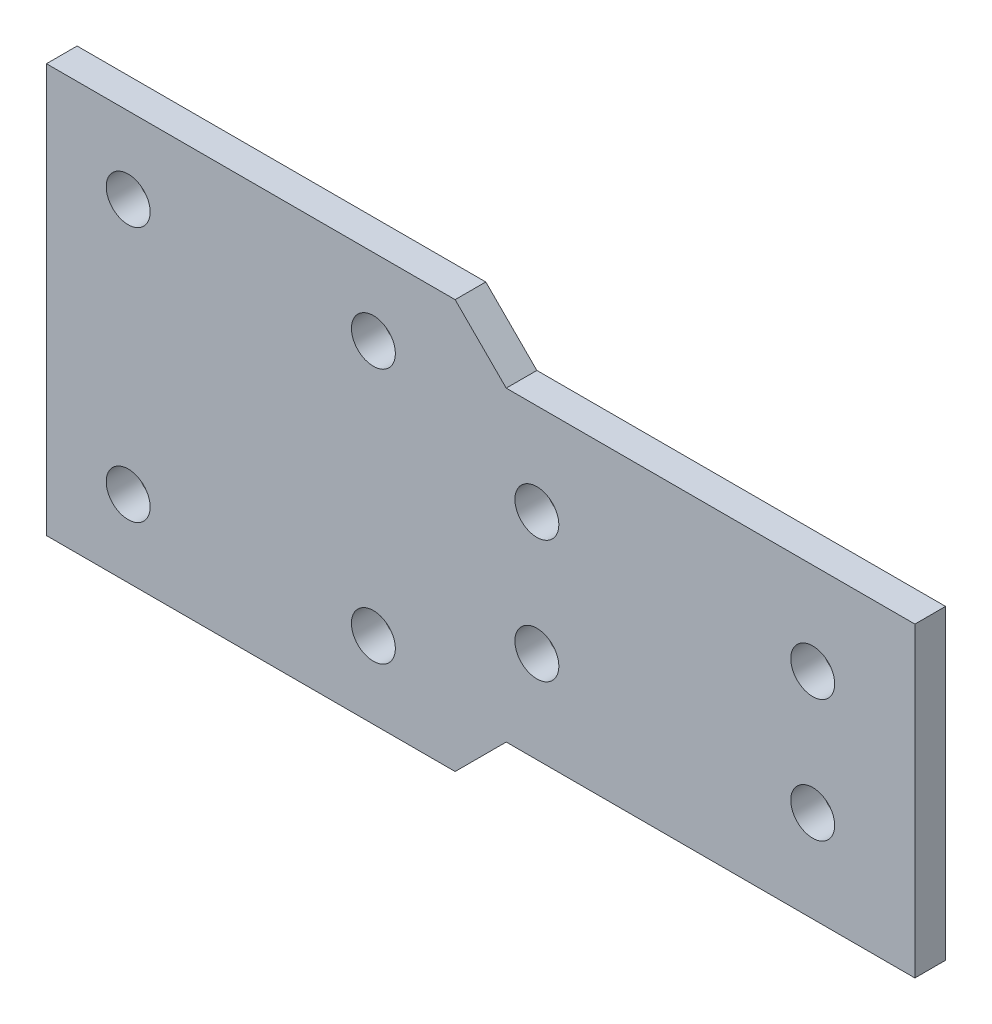
ISO-10303-21;
HEADER;
FILE_DESCRIPTION(('STEP AP214'),'2;1');
FILE_NAME('part.step','',(''),(''),'','','');
FILE_SCHEMA(('AUTOMOTIVE_DESIGN { 1 0 10303 214 1 1 1 1 }'));
ENDSEC;
DATA;
#1=APPLICATION_CONTEXT('core data for automotive mechanical design processes');
#2=APPLICATION_PROTOCOL_DEFINITION('international standard','automotive_design',2000,#1);
#3=PRODUCT_CONTEXT('',#1,'mechanical');
#4=PRODUCT('Part','Part','',(#3));
#5=PRODUCT_RELATED_PRODUCT_CATEGORY('part','',(#4));
#6=PRODUCT_DEFINITION_FORMATION('','',#4);
#7=PRODUCT_DEFINITION_CONTEXT('part definition',#1,'design');
#8=PRODUCT_DEFINITION('design','',#6,#7);
#9=PRODUCT_DEFINITION_SHAPE('','',#8);
#10=(LENGTH_UNIT() NAMED_UNIT(*) SI_UNIT(.MILLI.,.METRE.));
#11=(NAMED_UNIT(*) PLANE_ANGLE_UNIT() SI_UNIT($,.RADIAN.));
#12=(NAMED_UNIT(*) SI_UNIT($,.STERADIAN.) SOLID_ANGLE_UNIT());
#13=UNCERTAINTY_MEASURE_WITH_UNIT(LENGTH_MEASURE(1.E-05),#10,'distance_accuracy_value','');
#14=(GEOMETRIC_REPRESENTATION_CONTEXT(3) GLOBAL_UNCERTAINTY_ASSIGNED_CONTEXT((#13)) GLOBAL_UNIT_ASSIGNED_CONTEXT((#10,
#11,#12)) REPRESENTATION_CONTEXT('',''));
#15=CARTESIAN_POINT('',(0.,0.,0.));
#16=DIRECTION('',(0.,0.,1.));
#17=DIRECTION('',(1.,0.,0.));
#18=AXIS2_PLACEMENT_3D('',#15,#16,#17);
#19=CARTESIAN_POINT('',(0.,0.,3.));
#20=DIRECTION('',(0.,0.,1.));
#21=DIRECTION('',(1.,0.,0.));
#22=AXIS2_PLACEMENT_3D('',#19,#20,#21);
#23=PLANE('',#22);
#24=CARTESIAN_POINT('',(35.,5.99999999999999,3.));
#25=DIRECTION('',(0.,0.,1.));
#26=DIRECTION('',(1.,0.,0.));
#27=AXIS2_PLACEMENT_3D('',#24,#25,#26);
#28=CIRCLE('',#27,2.15);
#29=CARTESIAN_POINT('',(37.15,5.99999999999999,3.));
#30=VERTEX_POINT('',#29);
#31=EDGE_CURVE('E213',#30,#30,#28,.T.);
#32=ORIENTED_EDGE('',*,*,#31,.F.);
#33=EDGE_LOOP('',(#32));
#34=FACE_BOUND('',#33,.T.);
#35=CARTESIAN_POINT('',(8.,-6.00000000000001,3.));
#36=DIRECTION('',(0.,0.,1.));
#37=DIRECTION('',(1.,0.,0.));
#38=AXIS2_PLACEMENT_3D('',#35,#36,#37);
#39=CIRCLE('',#38,2.15);
#40=CARTESIAN_POINT('',(10.15,-6.00000000000001,3.));
#41=VERTEX_POINT('',#40);
#42=EDGE_CURVE('E201',#41,#41,#39,.T.);
#43=ORIENTED_EDGE('',*,*,#42,.F.);
#44=EDGE_LOOP('',(#43));
#45=FACE_BOUND('',#44,.T.);
#46=CARTESIAN_POINT('',(-32.,-12.5,3.));
#47=DIRECTION('',(0.,0.,1.));
#48=DIRECTION('',(1.,0.,0.));
#49=AXIS2_PLACEMENT_3D('',#46,#47,#48);
#50=CIRCLE('',#49,2.15);
#51=CARTESIAN_POINT('',(-29.85,-12.5,3.));
#52=VERTEX_POINT('',#51);
#53=EDGE_CURVE('E189',#52,#52,#50,.T.);
#54=ORIENTED_EDGE('',*,*,#53,.F.);
#55=EDGE_LOOP('',(#54));
#56=FACE_BOUND('',#55,.T.);
#57=CARTESIAN_POINT('',(-32.,12.5,3.));
#58=DIRECTION('',(0.,0.,1.));
#59=DIRECTION('',(1.,0.,0.));
#60=AXIS2_PLACEMENT_3D('',#57,#58,#59);
#61=CIRCLE('',#60,2.15);
#62=CARTESIAN_POINT('',(-29.85,12.5,3.));
#63=VERTEX_POINT('',#62);
#64=EDGE_CURVE('E135',#63,#63,#61,.T.);
#65=ORIENTED_EDGE('',*,*,#64,.F.);
#66=EDGE_LOOP('',(#65));
#67=FACE_BOUND('',#66,.T.);
#68=DIRECTION('',(0.,-1.,0.));
#69=VECTOR('',#68,1.);
#70=CARTESIAN_POINT('',(-40.,20.,3.));
#71=LINE('',#70,#69);
#72=CARTESIAN_POINT('',(-40.,20.,3.));
#73=VERTEX_POINT('',#72);
#74=CARTESIAN_POINT('',(-40.,-20.,3.));
#75=VERTEX_POINT('',#74);
#76=EDGE_CURVE('E146',#73,#75,#71,.T.);
#77=ORIENTED_EDGE('',*,*,#76,.T.);
#78=DIRECTION('',(1.,0.,0.));
#79=VECTOR('',#78,1.);
#80=CARTESIAN_POINT('',(-40.,-20.,3.));
#81=LINE('',#80,#79);
#82=CARTESIAN_POINT('',(0.,-20.,3.));
#83=VERTEX_POINT('',#82);
#84=EDGE_CURVE('E94',#75,#83,#81,.T.);
#85=ORIENTED_EDGE('',*,*,#84,.T.);
#86=DIRECTION('',(0.707106781186551,0.707106781186544,0.));
#87=VECTOR('',#86,1.);
#88=CARTESIAN_POINT('',(5.00000000000006,-15.,3.));
#89=LINE('',#88,#87);
#90=CARTESIAN_POINT('',(5.00000000000006,-15.,3.));
#91=VERTEX_POINT('',#90);
#92=EDGE_CURVE('E161',#83,#91,#89,.T.);
#93=ORIENTED_EDGE('',*,*,#92,.T.);
#94=DIRECTION('',(1.,0.,0.));
#95=VECTOR('',#94,1.);
#96=CARTESIAN_POINT('',(5.00000000000006,-15.,3.));
#97=LINE('',#96,#95);
#98=CARTESIAN_POINT('',(45.,-15.,3.));
#99=VERTEX_POINT('',#98);
#100=EDGE_CURVE('E174',#91,#99,#97,.T.);
#101=ORIENTED_EDGE('',*,*,#100,.T.);
#102=DIRECTION('',(0.,1.,0.));
#103=VECTOR('',#102,1.);
#104=CARTESIAN_POINT('',(45.,15.,3.));
#105=LINE('',#104,#103);
#106=CARTESIAN_POINT('',(45.,15.,3.));
#107=VERTEX_POINT('',#106);
#108=EDGE_CURVE('E113',#99,#107,#105,.T.);
#109=ORIENTED_EDGE('',*,*,#108,.T.);
#110=DIRECTION('',(-1.,0.,0.));
#111=VECTOR('',#110,1.);
#112=CARTESIAN_POINT('',(4.99999999999999,15.,3.));
#113=LINE('',#112,#111);
#114=CARTESIAN_POINT('',(4.99999999999999,15.,3.));
#115=VERTEX_POINT('',#114);
#116=EDGE_CURVE('E107',#107,#115,#113,.T.);
#117=ORIENTED_EDGE('',*,*,#116,.T.);
#118=DIRECTION('',(-0.707106781186546,0.707106781186549,0.));
#119=VECTOR('',#118,1.);
#120=CARTESIAN_POINT('',(0.,20.,3.));
#121=LINE('',#120,#119);
#122=CARTESIAN_POINT('',(0.,20.,3.));
#123=VERTEX_POINT('',#122);
#124=EDGE_CURVE('E111',#115,#123,#121,.T.);
#125=ORIENTED_EDGE('',*,*,#124,.T.);
#126=DIRECTION('',(-1.,0.,0.));
#127=VECTOR('',#126,1.);
#128=CARTESIAN_POINT('',(-40.,20.,3.));
#129=LINE('',#128,#127);
#130=EDGE_CURVE('E51',#123,#73,#129,.T.);
#131=ORIENTED_EDGE('',*,*,#130,.T.);
#132=EDGE_LOOP('',(#77,#85,#93,#101,#109,#117,#125,#131));
#133=FACE_BOUND('',#132,.T.);
#134=CARTESIAN_POINT('',(-8.,12.5,3.));
#135=DIRECTION('',(0.,0.,1.));
#136=DIRECTION('',(1.,0.,0.));
#137=AXIS2_PLACEMENT_3D('',#134,#135,#136);
#138=CIRCLE('',#137,2.15);
#139=CARTESIAN_POINT('',(-5.85,12.5,3.));
#140=VERTEX_POINT('',#139);
#141=EDGE_CURVE('E183',#140,#140,#138,.T.);
#142=ORIENTED_EDGE('',*,*,#141,.F.);
#143=EDGE_LOOP('',(#142));
#144=FACE_BOUND('',#143,.T.);
#145=CARTESIAN_POINT('',(-8.00000000000001,-12.5,3.));
#146=DIRECTION('',(0.,0.,1.));
#147=DIRECTION('',(1.,0.,0.));
#148=AXIS2_PLACEMENT_3D('',#145,#146,#147);
#149=CIRCLE('',#148,2.15);
#150=CARTESIAN_POINT('',(-5.85000000000001,-12.5,3.));
#151=VERTEX_POINT('',#150);
#152=EDGE_CURVE('E195',#151,#151,#149,.T.);
#153=ORIENTED_EDGE('',*,*,#152,.F.);
#154=EDGE_LOOP('',(#153));
#155=FACE_BOUND('',#154,.T.);
#156=CARTESIAN_POINT('',(8.,5.99999999999999,3.));
#157=DIRECTION('',(0.,0.,1.));
#158=DIRECTION('',(1.,0.,0.));
#159=AXIS2_PLACEMENT_3D('',#156,#157,#158);
#160=CIRCLE('',#159,2.15);
#161=CARTESIAN_POINT('',(10.15,5.99999999999999,3.));
#162=VERTEX_POINT('',#161);
#163=EDGE_CURVE('E207',#162,#162,#160,.T.);
#164=ORIENTED_EDGE('',*,*,#163,.F.);
#165=EDGE_LOOP('',(#164));
#166=FACE_BOUND('',#165,.T.);
#167=CARTESIAN_POINT('',(35.,-6.00000000000001,3.));
#168=DIRECTION('',(0.,0.,1.));
#169=DIRECTION('',(1.,0.,0.));
#170=AXIS2_PLACEMENT_3D('',#167,#168,#169);
#171=CIRCLE('',#170,2.15);
#172=CARTESIAN_POINT('',(37.15,-6.00000000000001,3.));
#173=VERTEX_POINT('',#172);
#174=EDGE_CURVE('E219',#173,#173,#171,.T.);
#175=ORIENTED_EDGE('',*,*,#174,.F.);
#176=EDGE_LOOP('',(#175));
#177=FACE_BOUND('',#176,.T.);
#178=ADVANCED_FACE('F34',(#34,#45,#56,#67,#133,#144,#155,#166,#177),#23,.T.);
#179=CARTESIAN_POINT('',(0.,0.,0.));
#180=DIRECTION('',(0.,0.,1.));
#181=DIRECTION('',(1.,0.,0.));
#182=AXIS2_PLACEMENT_3D('',#179,#180,#181);
#183=PLANE('',#182);
#184=DIRECTION('',(0.,-1.,0.));
#185=VECTOR('',#184,1.);
#186=CARTESIAN_POINT('',(-40.,20.,0.));
#187=LINE('',#186,#185);
#188=CARTESIAN_POINT('',(-40.,20.,0.));
#189=VERTEX_POINT('',#188);
#190=CARTESIAN_POINT('',(-40.,-20.,0.));
#191=VERTEX_POINT('',#190);
#192=EDGE_CURVE('E131',#189,#191,#187,.T.);
#193=ORIENTED_EDGE('',*,*,#192,.F.);
#194=DIRECTION('',(-1.,0.,0.));
#195=VECTOR('',#194,1.);
#196=CARTESIAN_POINT('',(-40.,20.,0.));
#197=LINE('',#196,#195);
#198=CARTESIAN_POINT('',(0.,20.,0.));
#199=VERTEX_POINT('',#198);
#200=EDGE_CURVE('E86',#199,#189,#197,.T.);
#201=ORIENTED_EDGE('',*,*,#200,.F.);
#202=DIRECTION('',(-0.707106781186546,0.707106781186549,0.));
#203=VECTOR('',#202,1.);
#204=CARTESIAN_POINT('',(0.,20.,0.));
#205=LINE('',#204,#203);
#206=CARTESIAN_POINT('',(4.99999999999999,15.,0.));
#207=VERTEX_POINT('',#206);
#208=EDGE_CURVE('E80',#207,#199,#205,.T.);
#209=ORIENTED_EDGE('',*,*,#208,.F.);
#210=DIRECTION('',(-1.,0.,0.));
#211=VECTOR('',#210,1.);
#212=CARTESIAN_POINT('',(4.99999999999999,15.,0.));
#213=LINE('',#212,#211);
#214=CARTESIAN_POINT('',(45.,15.,0.));
#215=VERTEX_POINT('',#214);
#216=EDGE_CURVE('E121',#215,#207,#213,.T.);
#217=ORIENTED_EDGE('',*,*,#216,.F.);
#218=DIRECTION('',(0.,1.,0.));
#219=VECTOR('',#218,1.);
#220=CARTESIAN_POINT('',(45.,15.,0.));
#221=LINE('',#220,#219);
#222=CARTESIAN_POINT('',(45.,-15.,0.));
#223=VERTEX_POINT('',#222);
#224=EDGE_CURVE('E141',#223,#215,#221,.T.);
#225=ORIENTED_EDGE('',*,*,#224,.F.);
#226=DIRECTION('',(1.,0.,0.));
#227=VECTOR('',#226,1.);
#228=CARTESIAN_POINT('',(5.00000000000006,-15.,0.));
#229=LINE('',#228,#227);
#230=CARTESIAN_POINT('',(5.00000000000006,-15.,0.));
#231=VERTEX_POINT('',#230);
#232=EDGE_CURVE('E139',#231,#223,#229,.T.);
#233=ORIENTED_EDGE('',*,*,#232,.F.);
#234=DIRECTION('',(0.707106781186551,0.707106781186544,0.));
#235=VECTOR('',#234,1.);
#236=CARTESIAN_POINT('',(5.00000000000006,-15.,0.));
#237=LINE('',#236,#235);
#238=CARTESIAN_POINT('',(0.,-20.,0.));
#239=VERTEX_POINT('',#238);
#240=EDGE_CURVE('E137',#239,#231,#237,.T.);
#241=ORIENTED_EDGE('',*,*,#240,.F.);
#242=DIRECTION('',(1.,0.,0.));
#243=VECTOR('',#242,1.);
#244=CARTESIAN_POINT('',(-40.,-20.,0.));
#245=LINE('',#244,#243);
#246=EDGE_CURVE('E134',#191,#239,#245,.T.);
#247=ORIENTED_EDGE('',*,*,#246,.F.);
#248=EDGE_LOOP('',(#193,#201,#209,#217,#225,#233,#241,#247));
#249=FACE_BOUND('',#248,.T.);
#250=CARTESIAN_POINT('',(-32.,12.5,0.));
#251=DIRECTION('',(0.,0.,1.));
#252=DIRECTION('',(1.,0.,0.));
#253=AXIS2_PLACEMENT_3D('',#250,#251,#252);
#254=CIRCLE('',#253,2.15);
#255=CARTESIAN_POINT('',(-29.85,12.5,0.));
#256=VERTEX_POINT('',#255);
#257=EDGE_CURVE('E180',#256,#256,#254,.T.);
#258=ORIENTED_EDGE('',*,*,#257,.T.);
#259=EDGE_LOOP('',(#258));
#260=FACE_BOUND('',#259,.T.);
#261=CARTESIAN_POINT('',(-8.,12.5,0.));
#262=DIRECTION('',(0.,0.,1.));
#263=DIRECTION('',(1.,0.,0.));
#264=AXIS2_PLACEMENT_3D('',#261,#262,#263);
#265=CIRCLE('',#264,2.15);
#266=CARTESIAN_POINT('',(-5.85,12.5,0.));
#267=VERTEX_POINT('',#266);
#268=EDGE_CURVE('E186',#267,#267,#265,.T.);
#269=ORIENTED_EDGE('',*,*,#268,.T.);
#270=EDGE_LOOP('',(#269));
#271=FACE_BOUND('',#270,.T.);
#272=CARTESIAN_POINT('',(-32.,-12.5,0.));
#273=DIRECTION('',(0.,0.,1.));
#274=DIRECTION('',(1.,0.,0.));
#275=AXIS2_PLACEMENT_3D('',#272,#273,#274);
#276=CIRCLE('',#275,2.15);
#277=CARTESIAN_POINT('',(-29.85,-12.5,0.));
#278=VERTEX_POINT('',#277);
#279=EDGE_CURVE('E192',#278,#278,#276,.T.);
#280=ORIENTED_EDGE('',*,*,#279,.T.);
#281=EDGE_LOOP('',(#280));
#282=FACE_BOUND('',#281,.T.);
#283=CARTESIAN_POINT('',(-8.00000000000001,-12.5,0.));
#284=DIRECTION('',(0.,0.,1.));
#285=DIRECTION('',(1.,0.,0.));
#286=AXIS2_PLACEMENT_3D('',#283,#284,#285);
#287=CIRCLE('',#286,2.15);
#288=CARTESIAN_POINT('',(-5.85000000000001,-12.5,0.));
#289=VERTEX_POINT('',#288);
#290=EDGE_CURVE('E198',#289,#289,#287,.T.);
#291=ORIENTED_EDGE('',*,*,#290,.T.);
#292=EDGE_LOOP('',(#291));
#293=FACE_BOUND('',#292,.T.);
#294=CARTESIAN_POINT('',(8.,-6.00000000000001,0.));
#295=DIRECTION('',(0.,0.,1.));
#296=DIRECTION('',(1.,0.,0.));
#297=AXIS2_PLACEMENT_3D('',#294,#295,#296);
#298=CIRCLE('',#297,2.15);
#299=CARTESIAN_POINT('',(10.15,-6.00000000000001,0.));
#300=VERTEX_POINT('',#299);
#301=EDGE_CURVE('E204',#300,#300,#298,.T.);
#302=ORIENTED_EDGE('',*,*,#301,.T.);
#303=EDGE_LOOP('',(#302));
#304=FACE_BOUND('',#303,.T.);
#305=CARTESIAN_POINT('',(8.,5.99999999999999,0.));
#306=DIRECTION('',(0.,0.,1.));
#307=DIRECTION('',(1.,0.,0.));
#308=AXIS2_PLACEMENT_3D('',#305,#306,#307);
#309=CIRCLE('',#308,2.15);
#310=CARTESIAN_POINT('',(10.15,5.99999999999999,0.));
#311=VERTEX_POINT('',#310);
#312=EDGE_CURVE('E210',#311,#311,#309,.T.);
#313=ORIENTED_EDGE('',*,*,#312,.T.);
#314=EDGE_LOOP('',(#313));
#315=FACE_BOUND('',#314,.T.);
#316=CARTESIAN_POINT('',(35.,5.99999999999999,0.));
#317=DIRECTION('',(0.,0.,1.));
#318=DIRECTION('',(1.,0.,0.));
#319=AXIS2_PLACEMENT_3D('',#316,#317,#318);
#320=CIRCLE('',#319,2.15);
#321=CARTESIAN_POINT('',(37.15,5.99999999999999,0.));
#322=VERTEX_POINT('',#321);
#323=EDGE_CURVE('E216',#322,#322,#320,.T.);
#324=ORIENTED_EDGE('',*,*,#323,.T.);
#325=EDGE_LOOP('',(#324));
#326=FACE_BOUND('',#325,.T.);
#327=CARTESIAN_POINT('',(35.,-6.00000000000001,0.));
#328=DIRECTION('',(0.,0.,1.));
#329=DIRECTION('',(1.,0.,0.));
#330=AXIS2_PLACEMENT_3D('',#327,#328,#329);
#331=CIRCLE('',#330,2.15);
#332=CARTESIAN_POINT('',(37.15,-6.00000000000001,0.));
#333=VERTEX_POINT('',#332);
#334=EDGE_CURVE('E222',#333,#333,#331,.T.);
#335=ORIENTED_EDGE('',*,*,#334,.T.);
#336=EDGE_LOOP('',(#335));
#337=FACE_BOUND('',#336,.T.);
#338=ADVANCED_FACE('F165',(#249,#260,#271,#282,#293,#304,#315,#326,#337),#183,.F.);
#339=CARTESIAN_POINT('',(-40.,20.,3.));
#340=DIRECTION('',(1.,0.,0.));
#341=DIRECTION('',(0.,0.,-1.));
#342=AXIS2_PLACEMENT_3D('',#339,#340,#341);
#343=PLANE('',#342);
#344=ORIENTED_EDGE('',*,*,#192,.T.);
#345=DIRECTION('',(0.,0.,-1.));
#346=VECTOR('',#345,1.);
#347=CARTESIAN_POINT('',(-40.,-20.,3.));
#348=LINE('',#347,#346);
#349=EDGE_CURVE('E11',#75,#191,#348,.T.);
#350=ORIENTED_EDGE('',*,*,#349,.F.);
#351=ORIENTED_EDGE('',*,*,#76,.F.);
#352=DIRECTION('',(0.,0.,-1.));
#353=VECTOR('',#352,1.);
#354=CARTESIAN_POINT('',(-40.,20.,3.));
#355=LINE('',#354,#353);
#356=EDGE_CURVE('E127',#73,#189,#355,.T.);
#357=ORIENTED_EDGE('',*,*,#356,.T.);
#358=EDGE_LOOP('',(#344,#350,#351,#357));
#359=FACE_BOUND('',#358,.T.);
#360=ADVANCED_FACE('F36',(#359),#343,.F.);
#361=CARTESIAN_POINT('',(-40.,-20.,3.));
#362=DIRECTION('',(0.,1.,0.));
#363=DIRECTION('',(0.,0.,1.));
#364=AXIS2_PLACEMENT_3D('',#361,#362,#363);
#365=PLANE('',#364);
#366=ORIENTED_EDGE('',*,*,#246,.T.);
#367=DIRECTION('',(0.,0.,-1.));
#368=VECTOR('',#367,1.);
#369=CARTESIAN_POINT('',(0.,-20.,3.));
#370=LINE('',#369,#368);
#371=EDGE_CURVE('E43',#83,#239,#370,.T.);
#372=ORIENTED_EDGE('',*,*,#371,.F.);
#373=ORIENTED_EDGE('',*,*,#84,.F.);
#374=ORIENTED_EDGE('',*,*,#349,.T.);
#375=EDGE_LOOP('',(#366,#372,#373,#374));
#376=FACE_BOUND('',#375,.T.);
#377=ADVANCED_FACE('F256',(#376),#365,.F.);
#378=CARTESIAN_POINT('',(5.00000000000006,-15.,3.));
#379=DIRECTION('',(-0.707106781186544,0.707106781186551,0.));
#380=DIRECTION('',(-0.707106781186551,-0.707106781186544,0.));
#381=AXIS2_PLACEMENT_3D('',#378,#379,#380);
#382=PLANE('',#381);
#383=ORIENTED_EDGE('',*,*,#240,.T.);
#384=DIRECTION('',(0.,0.,-1.));
#385=VECTOR('',#384,1.);
#386=CARTESIAN_POINT('',(5.00000000000006,-15.,3.));
#387=LINE('',#386,#385);
#388=EDGE_CURVE('E153',#91,#231,#387,.T.);
#389=ORIENTED_EDGE('',*,*,#388,.F.);
#390=ORIENTED_EDGE('',*,*,#92,.F.);
#391=ORIENTED_EDGE('',*,*,#371,.T.);
#392=EDGE_LOOP('',(#383,#389,#390,#391));
#393=FACE_BOUND('',#392,.T.);
#394=ADVANCED_FACE('F159',(#393),#382,.F.);
#395=CARTESIAN_POINT('',(5.00000000000006,-15.,3.));
#396=DIRECTION('',(0.,1.,0.));
#397=DIRECTION('',(0.,0.,1.));
#398=AXIS2_PLACEMENT_3D('',#395,#396,#397);
#399=PLANE('',#398);
#400=ORIENTED_EDGE('',*,*,#232,.T.);
#401=DIRECTION('',(0.,0.,-1.));
#402=VECTOR('',#401,1.);
#403=CARTESIAN_POINT('',(45.,-15.,3.));
#404=LINE('',#403,#402);
#405=EDGE_CURVE('E150',#99,#223,#404,.T.);
#406=ORIENTED_EDGE('',*,*,#405,.F.);
#407=ORIENTED_EDGE('',*,*,#100,.F.);
#408=ORIENTED_EDGE('',*,*,#388,.T.);
#409=EDGE_LOOP('',(#400,#406,#407,#408));
#410=FACE_BOUND('',#409,.T.);
#411=ADVANCED_FACE('F170',(#410),#399,.F.);
#412=CARTESIAN_POINT('',(45.,15.,3.));
#413=DIRECTION('',(-1.,0.,0.));
#414=DIRECTION('',(0.,-1.,0.));
#415=AXIS2_PLACEMENT_3D('',#412,#413,#414);
#416=PLANE('',#415);
#417=ORIENTED_EDGE('',*,*,#224,.T.);
#418=DIRECTION('',(0.,0.,-1.));
#419=VECTOR('',#418,1.);
#420=CARTESIAN_POINT('',(45.,15.,3.));
#421=LINE('',#420,#419);
#422=EDGE_CURVE('E122',#107,#215,#421,.T.);
#423=ORIENTED_EDGE('',*,*,#422,.F.);
#424=ORIENTED_EDGE('',*,*,#108,.F.);
#425=ORIENTED_EDGE('',*,*,#405,.T.);
#426=EDGE_LOOP('',(#417,#423,#424,#425));
#427=FACE_BOUND('',#426,.T.);
#428=ADVANCED_FACE('F173',(#427),#416,.F.);
#429=CARTESIAN_POINT('',(4.99999999999999,15.,3.));
#430=DIRECTION('',(0.,-1.,0.));
#431=DIRECTION('',(0.,0.,-1.));
#432=AXIS2_PLACEMENT_3D('',#429,#430,#431);
#433=PLANE('',#432);
#434=ORIENTED_EDGE('',*,*,#216,.T.);
#435=DIRECTION('',(0.,0.,-1.));
#436=VECTOR('',#435,1.);
#437=CARTESIAN_POINT('',(4.99999999999999,15.,3.));
#438=LINE('',#437,#436);
#439=EDGE_CURVE('E118',#115,#207,#438,.T.);
#440=ORIENTED_EDGE('',*,*,#439,.F.);
#441=ORIENTED_EDGE('',*,*,#116,.F.);
#442=ORIENTED_EDGE('',*,*,#422,.T.);
#443=EDGE_LOOP('',(#434,#440,#441,#442));
#444=FACE_BOUND('',#443,.T.);
#445=ADVANCED_FACE('F119',(#444),#433,.F.);
#446=CARTESIAN_POINT('',(0.,20.,3.));
#447=DIRECTION('',(-0.707106781186548,-0.707106781186546,0.));
#448=DIRECTION('',(0.707106781186546,-0.707106781186549,0.));
#449=AXIS2_PLACEMENT_3D('',#446,#447,#448);
#450=PLANE('',#449);
#451=ORIENTED_EDGE('',*,*,#208,.T.);
#452=DIRECTION('',(0.,0.,-1.));
#453=VECTOR('',#452,1.);
#454=CARTESIAN_POINT('',(0.,20.,3.));
#455=LINE('',#454,#453);
#456=EDGE_CURVE('E123',#123,#199,#455,.T.);
#457=ORIENTED_EDGE('',*,*,#456,.F.);
#458=ORIENTED_EDGE('',*,*,#124,.F.);
#459=ORIENTED_EDGE('',*,*,#439,.T.);
#460=EDGE_LOOP('',(#451,#457,#458,#459));
#461=FACE_BOUND('',#460,.T.);
#462=ADVANCED_FACE('F125',(#461),#450,.F.);
#463=CARTESIAN_POINT('',(-40.,20.,3.));
#464=DIRECTION('',(0.,-1.,0.));
#465=DIRECTION('',(0.,0.,-1.));
#466=AXIS2_PLACEMENT_3D('',#463,#464,#465);
#467=PLANE('',#466);
#468=ORIENTED_EDGE('',*,*,#200,.T.);
#469=ORIENTED_EDGE('',*,*,#356,.F.);
#470=ORIENTED_EDGE('',*,*,#130,.F.);
#471=ORIENTED_EDGE('',*,*,#456,.T.);
#472=EDGE_LOOP('',(#468,#469,#470,#471));
#473=FACE_BOUND('',#472,.T.);
#474=ADVANCED_FACE('F244',(#473),#467,.F.);
#475=CARTESIAN_POINT('',(-32.,12.5,3.));
#476=DIRECTION('',(0.,0.,-1.));
#477=DIRECTION('',(-1.,0.,0.));
#478=AXIS2_PLACEMENT_3D('',#475,#476,#477);
#479=CYLINDRICAL_SURFACE('',#478,2.15);
#480=ORIENTED_EDGE('',*,*,#64,.T.);
#481=EDGE_LOOP('',(#480));
#482=FACE_BOUND('',#481,.T.);
#483=ORIENTED_EDGE('',*,*,#257,.F.);
#484=EDGE_LOOP('',(#483));
#485=FACE_BOUND('',#484,.T.);
#486=ADVANCED_FACE('F241',(#482,#485),#479,.F.);
#487=CARTESIAN_POINT('',(-8.,12.5,3.));
#488=DIRECTION('',(0.,0.,-1.));
#489=DIRECTION('',(-1.,0.,0.));
#490=AXIS2_PLACEMENT_3D('',#487,#488,#489);
#491=CYLINDRICAL_SURFACE('',#490,2.15);
#492=ORIENTED_EDGE('',*,*,#141,.T.);
#493=EDGE_LOOP('',(#492));
#494=FACE_BOUND('',#493,.T.);
#495=ORIENTED_EDGE('',*,*,#268,.F.);
#496=EDGE_LOOP('',(#495));
#497=FACE_BOUND('',#496,.T.);
#498=ADVANCED_FACE('F320',(#494,#497),#491,.F.);
#499=CARTESIAN_POINT('',(-32.,-12.5,3.));
#500=DIRECTION('',(0.,0.,-1.));
#501=DIRECTION('',(-1.,0.,0.));
#502=AXIS2_PLACEMENT_3D('',#499,#500,#501);
#503=CYLINDRICAL_SURFACE('',#502,2.15);
#504=ORIENTED_EDGE('',*,*,#53,.T.);
#505=EDGE_LOOP('',(#504));
#506=FACE_BOUND('',#505,.T.);
#507=ORIENTED_EDGE('',*,*,#279,.F.);
#508=EDGE_LOOP('',(#507));
#509=FACE_BOUND('',#508,.T.);
#510=ADVANCED_FACE('F328',(#506,#509),#503,.F.);
#511=CARTESIAN_POINT('',(-8.00000000000001,-12.5,3.));
#512=DIRECTION('',(0.,0.,-1.));
#513=DIRECTION('',(-1.,0.,0.));
#514=AXIS2_PLACEMENT_3D('',#511,#512,#513);
#515=CYLINDRICAL_SURFACE('',#514,2.15);
#516=ORIENTED_EDGE('',*,*,#152,.T.);
#517=EDGE_LOOP('',(#516));
#518=FACE_BOUND('',#517,.T.);
#519=ORIENTED_EDGE('',*,*,#290,.F.);
#520=EDGE_LOOP('',(#519));
#521=FACE_BOUND('',#520,.T.);
#522=ADVANCED_FACE('F336',(#518,#521),#515,.F.);
#523=CARTESIAN_POINT('',(8.,-6.00000000000001,3.));
#524=DIRECTION('',(0.,0.,-1.));
#525=DIRECTION('',(-1.,0.,0.));
#526=AXIS2_PLACEMENT_3D('',#523,#524,#525);
#527=CYLINDRICAL_SURFACE('',#526,2.15);
#528=ORIENTED_EDGE('',*,*,#42,.T.);
#529=EDGE_LOOP('',(#528));
#530=FACE_BOUND('',#529,.T.);
#531=ORIENTED_EDGE('',*,*,#301,.F.);
#532=EDGE_LOOP('',(#531));
#533=FACE_BOUND('',#532,.T.);
#534=ADVANCED_FACE('F345',(#530,#533),#527,.F.);
#535=CARTESIAN_POINT('',(8.,5.99999999999999,3.));
#536=DIRECTION('',(0.,0.,-1.));
#537=DIRECTION('',(-1.,0.,0.));
#538=AXIS2_PLACEMENT_3D('',#535,#536,#537);
#539=CYLINDRICAL_SURFACE('',#538,2.15);
#540=ORIENTED_EDGE('',*,*,#163,.T.);
#541=EDGE_LOOP('',(#540));
#542=FACE_BOUND('',#541,.T.);
#543=ORIENTED_EDGE('',*,*,#312,.F.);
#544=EDGE_LOOP('',(#543));
#545=FACE_BOUND('',#544,.T.);
#546=ADVANCED_FACE('F354',(#542,#545),#539,.F.);
#547=CARTESIAN_POINT('',(35.,5.99999999999999,3.));
#548=DIRECTION('',(0.,0.,-1.));
#549=DIRECTION('',(-1.,0.,0.));
#550=AXIS2_PLACEMENT_3D('',#547,#548,#549);
#551=CYLINDRICAL_SURFACE('',#550,2.15);
#552=ORIENTED_EDGE('',*,*,#31,.T.);
#553=EDGE_LOOP('',(#552));
#554=FACE_BOUND('',#553,.T.);
#555=ORIENTED_EDGE('',*,*,#323,.F.);
#556=EDGE_LOOP('',(#555));
#557=FACE_BOUND('',#556,.T.);
#558=ADVANCED_FACE('F363',(#554,#557),#551,.F.);
#559=CARTESIAN_POINT('',(35.,-6.00000000000001,3.));
#560=DIRECTION('',(0.,0.,-1.));
#561=DIRECTION('',(-1.,0.,0.));
#562=AXIS2_PLACEMENT_3D('',#559,#560,#561);
#563=CYLINDRICAL_SURFACE('',#562,2.15);
#564=ORIENTED_EDGE('',*,*,#174,.T.);
#565=EDGE_LOOP('',(#564));
#566=FACE_BOUND('',#565,.T.);
#567=ORIENTED_EDGE('',*,*,#334,.F.);
#568=EDGE_LOOP('',(#567));
#569=FACE_BOUND('',#568,.T.);
#570=ADVANCED_FACE('F228',(#566,#569),#563,.F.);
#571=CLOSED_SHELL('',(#178,#338,#360,#377,#394,#411,#428,#445,#462,#474,#486,#498,#510,#522,
#534,#546,#558,#570));
#572=MANIFOLD_SOLID_BREP('B2',#571);
#573=ADVANCED_BREP_SHAPE_REPRESENTATION('',(#18,#572),#14);
#574=SHAPE_DEFINITION_REPRESENTATION(#9,#573);
ENDSEC;
END-ISO-10303-21;
